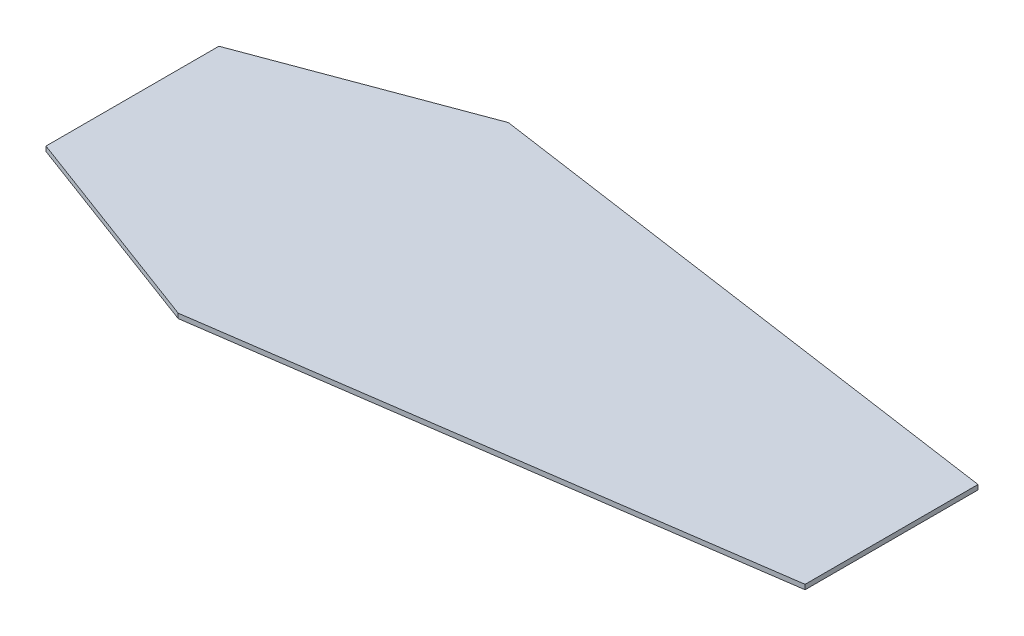
ISO-10303-21;
HEADER;
FILE_DESCRIPTION(('STEP AP214'),'2;1');
FILE_NAME('part.step','',(''),(''),'','','');
FILE_SCHEMA(('AUTOMOTIVE_DESIGN { 1 0 10303 214 1 1 1 1 }'));
ENDSEC;
DATA;
#1=APPLICATION_CONTEXT('core data for automotive mechanical design processes');
#2=APPLICATION_PROTOCOL_DEFINITION('international standard','automotive_design',2000,#1);
#3=PRODUCT_CONTEXT('',#1,'mechanical');
#4=PRODUCT('Part','Part','',(#3));
#5=PRODUCT_RELATED_PRODUCT_CATEGORY('part','',(#4));
#6=PRODUCT_DEFINITION_FORMATION('','',#4);
#7=PRODUCT_DEFINITION_CONTEXT('part definition',#1,'design');
#8=PRODUCT_DEFINITION('design','',#6,#7);
#9=PRODUCT_DEFINITION_SHAPE('','',#8);
#10=(LENGTH_UNIT() NAMED_UNIT(*) SI_UNIT(.MILLI.,.METRE.));
#11=(NAMED_UNIT(*) PLANE_ANGLE_UNIT() SI_UNIT($,.RADIAN.));
#12=(NAMED_UNIT(*) SI_UNIT($,.STERADIAN.) SOLID_ANGLE_UNIT());
#13=UNCERTAINTY_MEASURE_WITH_UNIT(LENGTH_MEASURE(1.E-05),#10,'distance_accuracy_value','');
#14=(GEOMETRIC_REPRESENTATION_CONTEXT(3) GLOBAL_UNCERTAINTY_ASSIGNED_CONTEXT((#13)) GLOBAL_UNIT_ASSIGNED_CONTEXT((#10,
#11,#12)) REPRESENTATION_CONTEXT('',''));
#15=CARTESIAN_POINT('',(0.,0.,0.));
#16=DIRECTION('',(0.,0.,1.));
#17=DIRECTION('',(1.,0.,0.));
#18=AXIS2_PLACEMENT_3D('',#15,#16,#17);
#19=CARTESIAN_POINT('',(-682.706817207399,14.2875,-592.607097462841));
#20=DIRECTION('',(0.349315522787269,0.,0.937005157691172));
#21=DIRECTION('',(0.937005157691172,0.,-0.349315522787269));
#22=AXIS2_PLACEMENT_3D('',#19,#20,#21);
#23=PLANE('',#22);
#24=DIRECTION('',(-0.937005157691172,0.,0.349315522787269));
#25=VECTOR('',#24,1.);
#26=CARTESIAN_POINT('',(-682.706817207399,0.,-592.607097462841));
#27=LINE('',#26,#25);
#28=CARTESIAN_POINT('',(-682.706817207399,0.,-592.607097462841));
#29=VERTEX_POINT('',#28);
#30=CARTESIAN_POINT('',(-1317.7068172074,0.,-355.879097462841));
#31=VERTEX_POINT('',#30);
#32=EDGE_CURVE('E116',#29,#31,#27,.T.);
#33=ORIENTED_EDGE('',*,*,#32,.T.);
#34=DIRECTION('',(0.,-1.,0.));
#35=VECTOR('',#34,1.);
#36=CARTESIAN_POINT('',(-1317.7068172074,14.2875,-355.879097462841));
#37=LINE('',#36,#35);
#38=CARTESIAN_POINT('',(-1317.7068172074,14.2875,-355.879097462841));
#39=VERTEX_POINT('',#38);
#40=EDGE_CURVE('E11',#39,#31,#37,.T.);
#41=ORIENTED_EDGE('',*,*,#40,.F.);
#42=DIRECTION('',(-0.937005157691172,0.,0.349315522787269));
#43=VECTOR('',#42,1.);
#44=CARTESIAN_POINT('',(-682.706817207399,14.2875,-592.607097462841));
#45=LINE('',#44,#43);
#46=CARTESIAN_POINT('',(-682.706817207399,14.2875,-592.607097462841));
#47=VERTEX_POINT('',#46);
#48=EDGE_CURVE('E126',#47,#39,#45,.T.);
#49=ORIENTED_EDGE('',*,*,#48,.F.);
#50=DIRECTION('',(0.,-1.,0.));
#51=VECTOR('',#50,1.);
#52=CARTESIAN_POINT('',(-682.706817207399,14.2875,-592.607097462841));
#53=LINE('',#52,#51);
#54=EDGE_CURVE('E112',#47,#29,#53,.T.);
#55=ORIENTED_EDGE('',*,*,#54,.T.);
#56=EDGE_LOOP('',(#33,#41,#49,#55));
#57=FACE_BOUND('',#56,.T.);
#58=ADVANCED_FACE('F32',(#57),#23,.F.);
#59=CARTESIAN_POINT('',(-1317.7068172074,14.2875,-355.879097462841));
#60=DIRECTION('',(1.,0.,0.));
#61=DIRECTION('',(0.,0.,-1.));
#62=AXIS2_PLACEMENT_3D('',#59,#60,#61);
#63=PLANE('',#62);
#64=DIRECTION('',(0.,0.,1.));
#65=VECTOR('',#64,1.);
#66=CARTESIAN_POINT('',(-1317.7068172074,0.,-355.879097462841));
#67=LINE('',#66,#65);
#68=CARTESIAN_POINT('',(-1317.7068172074,0.,164.820902537159));
#69=VERTEX_POINT('',#68);
#70=EDGE_CURVE('E119',#31,#69,#67,.T.);
#71=ORIENTED_EDGE('',*,*,#70,.T.);
#72=DIRECTION('',(0.,-1.,0.));
#73=VECTOR('',#72,1.);
#74=CARTESIAN_POINT('',(-1317.7068172074,14.2875,164.820902537159));
#75=LINE('',#74,#73);
#76=CARTESIAN_POINT('',(-1317.7068172074,14.2875,164.820902537159));
#77=VERTEX_POINT('',#76);
#78=EDGE_CURVE('E40',#77,#69,#75,.T.);
#79=ORIENTED_EDGE('',*,*,#78,.F.);
#80=DIRECTION('',(0.,0.,1.));
#81=VECTOR('',#80,1.);
#82=CARTESIAN_POINT('',(-1317.7068172074,14.2875,-355.879097462841));
#83=LINE('',#82,#81);
#84=EDGE_CURVE('E85',#39,#77,#83,.T.);
#85=ORIENTED_EDGE('',*,*,#84,.F.);
#86=ORIENTED_EDGE('',*,*,#40,.T.);
#87=EDGE_LOOP('',(#71,#79,#85,#86));
#88=FACE_BOUND('',#87,.T.);
#89=ADVANCED_FACE('F150',(#88),#63,.F.);
#90=CARTESIAN_POINT('',(-1317.7068172074,14.2875,164.820902537159));
#91=DIRECTION('',(0.349336089298276,0.,-0.936997490238788));
#92=DIRECTION('',(-0.936997490238787,0.,-0.349336089298276));
#93=AXIS2_PLACEMENT_3D('',#90,#91,#92);
#94=PLANE('',#93);
#95=DIRECTION('',(0.936997490238787,0.,0.349336089298276));
#96=VECTOR('',#95,1.);
#97=CARTESIAN_POINT('',(-1317.7068172074,0.,164.820902537159));
#98=LINE('',#97,#96);
#99=CARTESIAN_POINT('',(-682.706817207399,0.,401.564777537159));
#100=VERTEX_POINT('',#99);
#101=EDGE_CURVE('E121',#69,#100,#98,.T.);
#102=ORIENTED_EDGE('',*,*,#101,.T.);
#103=DIRECTION('',(0.,-1.,0.));
#104=VECTOR('',#103,1.);
#105=CARTESIAN_POINT('',(-682.706817207399,14.2875,401.564777537159));
#106=LINE('',#105,#104);
#107=CARTESIAN_POINT('',(-682.706817207399,14.2875,401.564777537159));
#108=VERTEX_POINT('',#107);
#109=EDGE_CURVE('E107',#108,#100,#106,.T.);
#110=ORIENTED_EDGE('',*,*,#109,.F.);
#111=DIRECTION('',(0.936997490238787,0.,0.349336089298276));
#112=VECTOR('',#111,1.);
#113=CARTESIAN_POINT('',(-1317.7068172074,14.2875,164.820902537159));
#114=LINE('',#113,#112);
#115=EDGE_CURVE('E98',#77,#108,#114,.T.);
#116=ORIENTED_EDGE('',*,*,#115,.F.);
#117=ORIENTED_EDGE('',*,*,#78,.T.);
#118=EDGE_LOOP('',(#102,#110,#116,#117));
#119=FACE_BOUND('',#118,.T.);
#120=ADVANCED_FACE('F132',(#119),#94,.F.);
#121=CARTESIAN_POINT('',(-682.706817207399,14.2875,401.564777537159));
#122=DIRECTION('',(-0.141942353510418,0.,-0.989874925573895));
#123=DIRECTION('',(-0.989874925573895,0.,0.141942353510418));
#124=AXIS2_PLACEMENT_3D('',#121,#122,#123);
#125=PLANE('',#124);
#126=DIRECTION('',(0.989874925573894,0.,-0.141942353510418));
#127=VECTOR('',#126,1.);
#128=CARTESIAN_POINT('',(-682.706817207399,0.,401.564777537159));
#129=LINE('',#128,#127);
#130=CARTESIAN_POINT('',(968.293182792601,0.,164.820902537159));
#131=VERTEX_POINT('',#130);
#132=EDGE_CURVE('E106',#100,#131,#129,.T.);
#133=ORIENTED_EDGE('',*,*,#132,.T.);
#134=DIRECTION('',(0.,-1.,0.));
#135=VECTOR('',#134,1.);
#136=CARTESIAN_POINT('',(968.293182792601,14.2875,164.820902537159));
#137=LINE('',#136,#135);
#138=CARTESIAN_POINT('',(968.293182792601,14.2875,164.820902537159));
#139=VERTEX_POINT('',#138);
#140=EDGE_CURVE('E103',#139,#131,#137,.T.);
#141=ORIENTED_EDGE('',*,*,#140,.F.);
#142=DIRECTION('',(0.989874925573894,0.,-0.141942353510418));
#143=VECTOR('',#142,1.);
#144=CARTESIAN_POINT('',(-682.706817207399,14.2875,401.564777537159));
#145=LINE('',#144,#143);
#146=EDGE_CURVE('E92',#108,#139,#145,.T.);
#147=ORIENTED_EDGE('',*,*,#146,.F.);
#148=ORIENTED_EDGE('',*,*,#109,.T.);
#149=EDGE_LOOP('',(#133,#141,#147,#148));
#150=FACE_BOUND('',#149,.T.);
#151=ADVANCED_FACE('F104',(#150),#125,.F.);
#152=CARTESIAN_POINT('',(968.293182792601,14.2875,-355.879097462841));
#153=DIRECTION('',(-1.,0.,0.));
#154=DIRECTION('',(0.,0.,1.));
#155=AXIS2_PLACEMENT_3D('',#152,#153,#154);
#156=PLANE('',#155);
#157=DIRECTION('',(0.,0.,-1.));
#158=VECTOR('',#157,1.);
#159=CARTESIAN_POINT('',(968.293182792601,0.,-355.879097462841));
#160=LINE('',#159,#158);
#161=CARTESIAN_POINT('',(968.293182792601,0.,-355.879097462841));
#162=VERTEX_POINT('',#161);
#163=EDGE_CURVE('E71',#131,#162,#160,.T.);
#164=ORIENTED_EDGE('',*,*,#163,.T.);
#165=DIRECTION('',(0.,-1.,0.));
#166=VECTOR('',#165,1.);
#167=CARTESIAN_POINT('',(968.293182792601,14.2875,-355.879097462841));
#168=LINE('',#167,#166);
#169=CARTESIAN_POINT('',(968.293182792601,14.2875,-355.879097462841));
#170=VERTEX_POINT('',#169);
#171=EDGE_CURVE('E108',#170,#162,#168,.T.);
#172=ORIENTED_EDGE('',*,*,#171,.F.);
#173=DIRECTION('',(0.,0.,-1.));
#174=VECTOR('',#173,1.);
#175=CARTESIAN_POINT('',(968.293182792601,14.2875,-355.879097462841));
#176=LINE('',#175,#174);
#177=EDGE_CURVE('E96',#139,#170,#176,.T.);
#178=ORIENTED_EDGE('',*,*,#177,.F.);
#179=ORIENTED_EDGE('',*,*,#140,.T.);
#180=EDGE_LOOP('',(#164,#172,#178,#179));
#181=FACE_BOUND('',#180,.T.);
#182=ADVANCED_FACE('F110',(#181),#156,.F.);
#183=CARTESIAN_POINT('',(-682.706817207399,14.2875,-592.607097462841));
#184=DIRECTION('',(-0.141933027229114,0.,0.98987626286399));
#185=DIRECTION('',(0.98987626286399,0.,0.141933027229114));
#186=AXIS2_PLACEMENT_3D('',#183,#184,#185);
#187=PLANE('',#186);
#188=DIRECTION('',(-0.98987626286399,0.,-0.141933027229114));
#189=VECTOR('',#188,1.);
#190=CARTESIAN_POINT('',(-682.706817207399,0.,-592.607097462841));
#191=LINE('',#190,#189);
#192=EDGE_CURVE('E77',#162,#29,#191,.T.);
#193=ORIENTED_EDGE('',*,*,#192,.T.);
#194=ORIENTED_EDGE('',*,*,#54,.F.);
#195=DIRECTION('',(-0.98987626286399,0.,-0.141933027229114));
#196=VECTOR('',#195,1.);
#197=CARTESIAN_POINT('',(-682.706817207399,14.2875,-592.607097462841));
#198=LINE('',#197,#196);
#199=EDGE_CURVE('E48',#170,#47,#198,.T.);
#200=ORIENTED_EDGE('',*,*,#199,.F.);
#201=ORIENTED_EDGE('',*,*,#171,.T.);
#202=EDGE_LOOP('',(#193,#194,#200,#201));
#203=FACE_BOUND('',#202,.T.);
#204=ADVANCED_FACE('F139',(#203),#187,.F.);
#205=CARTESIAN_POINT('',(0.,14.2875,0.));
#206=DIRECTION('',(0.,1.,0.));
#207=DIRECTION('',(0.,0.,1.));
#208=AXIS2_PLACEMENT_3D('',#205,#206,#207);
#209=PLANE('',#208);
#210=ORIENTED_EDGE('',*,*,#48,.T.);
#211=ORIENTED_EDGE('',*,*,#84,.T.);
#212=ORIENTED_EDGE('',*,*,#115,.T.);
#213=ORIENTED_EDGE('',*,*,#146,.T.);
#214=ORIENTED_EDGE('',*,*,#177,.T.);
#215=ORIENTED_EDGE('',*,*,#199,.T.);
#216=EDGE_LOOP('',(#210,#211,#212,#213,#214,#215));
#217=FACE_BOUND('',#216,.T.);
#218=ADVANCED_FACE('F94',(#217),#209,.T.);
#219=CARTESIAN_POINT('',(0.,0.,0.));
#220=DIRECTION('',(0.,1.,0.));
#221=DIRECTION('',(0.,0.,1.));
#222=AXIS2_PLACEMENT_3D('',#219,#220,#221);
#223=PLANE('',#222);
#224=ORIENTED_EDGE('',*,*,#32,.F.);
#225=ORIENTED_EDGE('',*,*,#192,.F.);
#226=ORIENTED_EDGE('',*,*,#163,.F.);
#227=ORIENTED_EDGE('',*,*,#132,.F.);
#228=ORIENTED_EDGE('',*,*,#101,.F.);
#229=ORIENTED_EDGE('',*,*,#70,.F.);
#230=EDGE_LOOP('',(#224,#225,#226,#227,#228,#229));
#231=FACE_BOUND('',#230,.T.);
#232=ADVANCED_FACE('F135',(#231),#223,.F.);
#233=CLOSED_SHELL('',(#58,#89,#120,#151,#182,#204,#218,#232));
#234=MANIFOLD_SOLID_BREP('B2',#233);
#235=ADVANCED_BREP_SHAPE_REPRESENTATION('',(#18,#234),#14);
#236=SHAPE_DEFINITION_REPRESENTATION(#9,#235);
ENDSEC;
END-ISO-10303-21;
